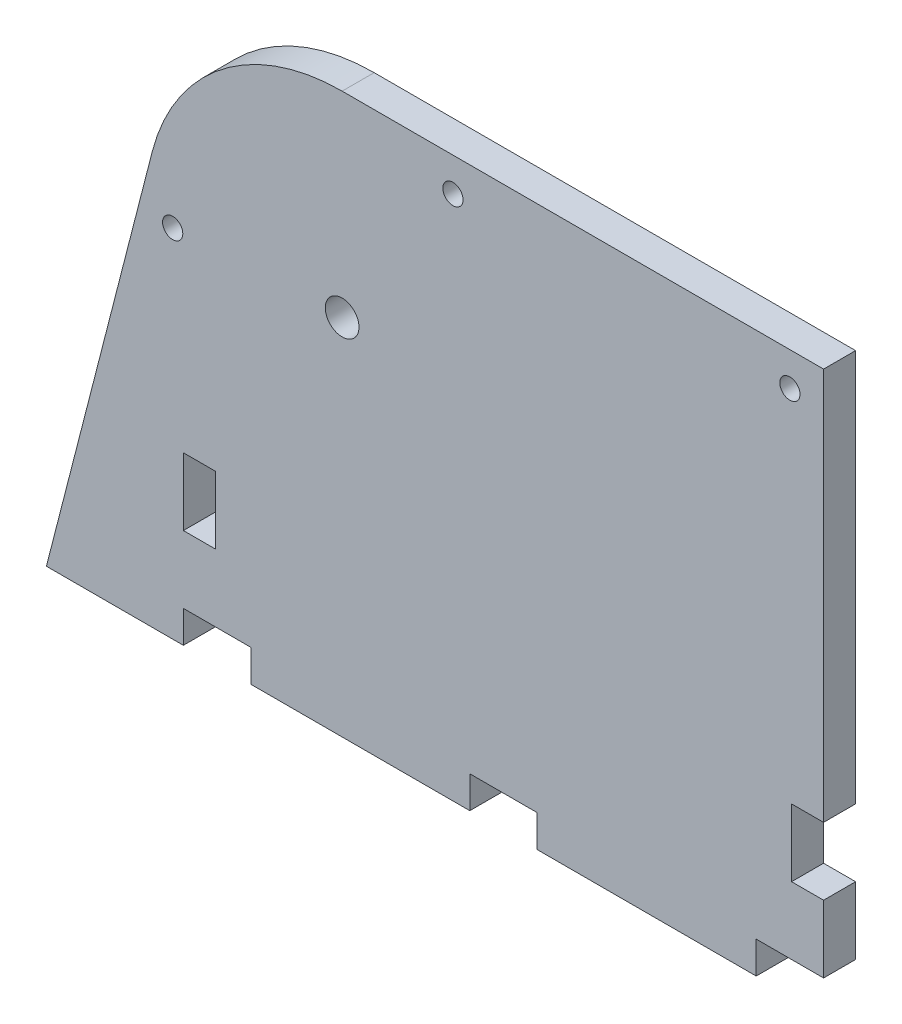
ISO-10303-21;
HEADER;
FILE_DESCRIPTION(('STEP AP214'),'2;1');
FILE_NAME('part.step','',(''),(''),'','','');
FILE_SCHEMA(('AUTOMOTIVE_DESIGN { 1 0 10303 214 1 1 1 1 }'));
ENDSEC;
DATA;
#1=APPLICATION_CONTEXT('core data for automotive mechanical design processes');
#2=APPLICATION_PROTOCOL_DEFINITION('international standard','automotive_design',2000,#1);
#3=PRODUCT_CONTEXT('',#1,'mechanical');
#4=PRODUCT('Part','Part','',(#3));
#5=PRODUCT_RELATED_PRODUCT_CATEGORY('part','',(#4));
#6=PRODUCT_DEFINITION_FORMATION('','',#4);
#7=PRODUCT_DEFINITION_CONTEXT('part definition',#1,'design');
#8=PRODUCT_DEFINITION('design','',#6,#7);
#9=PRODUCT_DEFINITION_SHAPE('','',#8);
#10=(LENGTH_UNIT() NAMED_UNIT(*) SI_UNIT(.MILLI.,.METRE.));
#11=(NAMED_UNIT(*) PLANE_ANGLE_UNIT() SI_UNIT($,.RADIAN.));
#12=(NAMED_UNIT(*) SI_UNIT($,.STERADIAN.) SOLID_ANGLE_UNIT());
#13=UNCERTAINTY_MEASURE_WITH_UNIT(LENGTH_MEASURE(1.E-05),#10,'distance_accuracy_value','');
#14=(GEOMETRIC_REPRESENTATION_CONTEXT(3) GLOBAL_UNCERTAINTY_ASSIGNED_CONTEXT((#13)) GLOBAL_UNIT_ASSIGNED_CONTEXT((#10,
#11,#12)) REPRESENTATION_CONTEXT('',''));
#15=CARTESIAN_POINT('',(0.,0.,0.));
#16=DIRECTION('',(0.,0.,1.));
#17=DIRECTION('',(1.,0.,0.));
#18=AXIS2_PLACEMENT_3D('',#15,#16,#17);
#19=CARTESIAN_POINT('',(105.,0.,4.75));
#20=DIRECTION('',(0.,1.,0.));
#21=DIRECTION('',(-1.,0.,0.));
#22=AXIS2_PLACEMENT_3D('',#19,#20,#21);
#23=PLANE('',#22);
#24=DIRECTION('',(1.,0.,0.));
#25=VECTOR('',#24,1.);
#26=CARTESIAN_POINT('',(105.,0.,0.));
#27=LINE('',#26,#25);
#28=CARTESIAN_POINT('',(20.,0.,0.));
#29=VERTEX_POINT('',#28);
#30=CARTESIAN_POINT('',(52.5,0.,0.));
#31=VERTEX_POINT('',#30);
#32=EDGE_CURVE('E209',#29,#31,#27,.T.);
#33=ORIENTED_EDGE('',*,*,#32,.T.);
#34=DIRECTION('',(0.,0.,1.));
#35=VECTOR('',#34,1.);
#36=CARTESIAN_POINT('',(52.5,0.,0.));
#37=LINE('',#36,#35);
#38=CARTESIAN_POINT('',(52.5,0.,4.75));
#39=VERTEX_POINT('',#38);
#40=EDGE_CURVE('E189',#31,#39,#37,.T.);
#41=ORIENTED_EDGE('',*,*,#40,.T.);
#42=DIRECTION('',(1.,0.,0.));
#43=VECTOR('',#42,1.);
#44=CARTESIAN_POINT('',(105.,0.,4.75));
#45=LINE('',#44,#43);
#46=CARTESIAN_POINT('',(20.,0.,4.75));
#47=VERTEX_POINT('',#46);
#48=EDGE_CURVE('E272',#47,#39,#45,.T.);
#49=ORIENTED_EDGE('',*,*,#48,.F.);
#50=DIRECTION('',(0.,0.,1.));
#51=VECTOR('',#50,1.);
#52=CARTESIAN_POINT('',(20.,0.,0.));
#53=LINE('',#52,#51);
#54=EDGE_CURVE('E216',#29,#47,#53,.T.);
#55=ORIENTED_EDGE('',*,*,#54,.F.);
#56=EDGE_LOOP('',(#33,#41,#49,#55));
#57=FACE_BOUND('',#56,.T.);
#58=ADVANCED_FACE('F33',(#57),#23,.F.);
#59=CARTESIAN_POINT('',(-10.3247928552616,0.,0.));
#60=VERTEX_POINT('',#59);
#61=CARTESIAN_POINT('',(10.,0.,0.));
#62=VERTEX_POINT('',#61);
#63=EDGE_CURVE('E217',#60,#62,#27,.T.);
#64=ORIENTED_EDGE('',*,*,#63,.T.);
#65=DIRECTION('',(0.,0.,1.));
#66=VECTOR('',#65,1.);
#67=CARTESIAN_POINT('',(10.,0.,0.));
#68=LINE('',#67,#66);
#69=CARTESIAN_POINT('',(10.,0.,4.75));
#70=VERTEX_POINT('',#69);
#71=EDGE_CURVE('E268',#62,#70,#68,.T.);
#72=ORIENTED_EDGE('',*,*,#71,.T.);
#73=CARTESIAN_POINT('',(-10.3247928552616,0.,4.75));
#74=VERTEX_POINT('',#73);
#75=EDGE_CURVE('E267',#74,#70,#45,.T.);
#76=ORIENTED_EDGE('',*,*,#75,.F.);
#77=DIRECTION('',(0.,0.,-1.));
#78=VECTOR('',#77,1.);
#79=CARTESIAN_POINT('',(-10.3247928552616,0.,4.75));
#80=LINE('',#79,#78);
#81=EDGE_CURVE('E238',#74,#60,#80,.T.);
#82=ORIENTED_EDGE('',*,*,#81,.T.);
#83=EDGE_LOOP('',(#64,#72,#76,#82));
#84=FACE_BOUND('',#83,.T.);
#85=ADVANCED_FACE('F264',(#84),#23,.F.);
#86=CARTESIAN_POINT('',(105.,83.,4.75));
#87=DIRECTION('',(-1.,0.,0.));
#88=DIRECTION('',(0.,-1.,0.));
#89=AXIS2_PLACEMENT_3D('',#86,#87,#88);
#90=PLANE('',#89);
#91=DIRECTION('',(0.,1.,0.));
#92=VECTOR('',#91,1.);
#93=CARTESIAN_POINT('',(105.,83.,0.));
#94=LINE('',#93,#92);
#95=CARTESIAN_POINT('',(105.,4.75000000000003,0.));
#96=VERTEX_POINT('',#95);
#97=CARTESIAN_POINT('',(105.,14.75,0.));
#98=VERTEX_POINT('',#97);
#99=EDGE_CURVE('E229',#96,#98,#94,.T.);
#100=ORIENTED_EDGE('',*,*,#99,.T.);
#101=DIRECTION('',(0.,0.,1.));
#102=VECTOR('',#101,1.);
#103=CARTESIAN_POINT('',(105.,14.75,0.));
#104=LINE('',#103,#102);
#105=CARTESIAN_POINT('',(105.,14.75,4.75));
#106=VERTEX_POINT('',#105);
#107=EDGE_CURVE('E325',#98,#106,#104,.T.);
#108=ORIENTED_EDGE('',*,*,#107,.T.);
#109=DIRECTION('',(0.,1.,0.));
#110=VECTOR('',#109,1.);
#111=CARTESIAN_POINT('',(105.,83.,4.75));
#112=LINE('',#111,#110);
#113=CARTESIAN_POINT('',(105.,4.75,4.75));
#114=VERTEX_POINT('',#113);
#115=EDGE_CURVE('E274',#114,#106,#112,.T.);
#116=ORIENTED_EDGE('',*,*,#115,.F.);
#117=DIRECTION('',(0.,0.,1.));
#118=VECTOR('',#117,1.);
#119=CARTESIAN_POINT('',(105.,4.75,0.));
#120=LINE('',#119,#118);
#121=EDGE_CURVE('E297',#96,#114,#120,.T.);
#122=ORIENTED_EDGE('',*,*,#121,.F.);
#123=EDGE_LOOP('',(#100,#108,#116,#122));
#124=FACE_BOUND('',#123,.T.);
#125=ADVANCED_FACE('F406',(#124),#90,.F.);
#126=CARTESIAN_POINT('',(33.5613886077065,53.9097221037271,4.75));
#127=DIRECTION('',(0.,0.,-1.));
#128=DIRECTION('',(-1.,0.,0.));
#129=AXIS2_PLACEMENT_3D('',#126,#127,#128);
#130=PLANE('',#129);
#131=CARTESIAN_POINT('',(8.41486022586613,52.8440056136109,4.75));
#132=DIRECTION('',(0.,0.,-1.));
#133=DIRECTION('',(-1.,0.,0.));
#134=AXIS2_PLACEMENT_3D('',#131,#132,#133);
#135=CIRCLE('',#134,1.5);
#136=CARTESIAN_POINT('',(9.91486022586613,52.8440056136109,4.75));
#137=VERTEX_POINT('',#136);
#138=EDGE_CURVE('E472',#137,#137,#135,.F.);
#139=ORIENTED_EDGE('',*,*,#138,.F.);
#140=EDGE_LOOP('',(#139));
#141=FACE_BOUND('',#140,.T.);
#142=CARTESIAN_POINT('',(50.,78.,4.75));
#143=DIRECTION('',(0.,0.,1.));
#144=DIRECTION('',(1.,0.,0.));
#145=AXIS2_PLACEMENT_3D('',#142,#143,#144);
#146=CIRCLE('',#145,1.5);
#147=CARTESIAN_POINT('',(51.5,78.,4.75));
#148=VERTEX_POINT('',#147);
#149=EDGE_CURVE('E475',#148,#148,#146,.T.);
#150=ORIENTED_EDGE('',*,*,#149,.F.);
#151=EDGE_LOOP('',(#150));
#152=FACE_BOUND('',#151,.T.);
#153=CARTESIAN_POINT('',(100.,78.,4.75));
#154=DIRECTION('',(0.,0.,1.));
#155=DIRECTION('',(1.,0.,0.));
#156=AXIS2_PLACEMENT_3D('',#153,#154,#155);
#157=CIRCLE('',#156,1.5);
#158=CARTESIAN_POINT('',(101.5,78.,4.75));
#159=VERTEX_POINT('',#158);
#160=EDGE_CURVE('E468',#159,#159,#157,.T.);
#161=ORIENTED_EDGE('',*,*,#160,.F.);
#162=EDGE_LOOP('',(#161));
#163=FACE_BOUND('',#162,.T.);
#164=DIRECTION('',(1.,0.,0.));
#165=VECTOR('',#164,1.);
#166=CARTESIAN_POINT('',(10.,14.75,4.75));
#167=LINE('',#166,#165);
#168=CARTESIAN_POINT('',(10.,14.75,4.75));
#169=VERTEX_POINT('',#168);
#170=CARTESIAN_POINT('',(14.75,14.75,4.75));
#171=VERTEX_POINT('',#170);
#172=EDGE_CURVE('E346',#169,#171,#167,.T.);
#173=ORIENTED_EDGE('',*,*,#172,.F.);
#174=DIRECTION('',(0.,-1.,0.));
#175=VECTOR('',#174,1.);
#176=CARTESIAN_POINT('',(10.,14.75,4.75));
#177=LINE('',#176,#175);
#178=CARTESIAN_POINT('',(10.,24.75,4.75));
#179=VERTEX_POINT('',#178);
#180=EDGE_CURVE('E49',#179,#169,#177,.T.);
#181=ORIENTED_EDGE('',*,*,#180,.F.);
#182=DIRECTION('',(-1.,0.,0.));
#183=VECTOR('',#182,1.);
#184=CARTESIAN_POINT('',(10.,24.75,4.75));
#185=LINE('',#184,#183);
#186=CARTESIAN_POINT('',(14.75,24.75,4.75));
#187=VERTEX_POINT('',#186);
#188=EDGE_CURVE('E337',#187,#179,#185,.T.);
#189=ORIENTED_EDGE('',*,*,#188,.F.);
#190=DIRECTION('',(0.,1.,0.));
#191=VECTOR('',#190,1.);
#192=CARTESIAN_POINT('',(14.75,14.75,4.75));
#193=LINE('',#192,#191);
#194=EDGE_CURVE('E350',#171,#187,#193,.T.);
#195=ORIENTED_EDGE('',*,*,#194,.F.);
#196=EDGE_LOOP('',(#173,#181,#189,#195));
#197=FACE_BOUND('',#196,.T.);
#198=ORIENTED_EDGE('',*,*,#115,.T.);
#199=DIRECTION('',(1.,0.,0.));
#200=VECTOR('',#199,1.);
#201=CARTESIAN_POINT('',(105.,14.75,4.75));
#202=LINE('',#201,#200);
#203=CARTESIAN_POINT('',(100.25,14.75,4.75));
#204=VERTEX_POINT('',#203);
#205=EDGE_CURVE('E311',#204,#106,#202,.T.);
#206=ORIENTED_EDGE('',*,*,#205,.F.);
#207=DIRECTION('',(0.,-1.,0.));
#208=VECTOR('',#207,1.);
#209=CARTESIAN_POINT('',(100.25,24.75,4.75));
#210=LINE('',#209,#208);
#211=CARTESIAN_POINT('',(100.25,24.75,4.75));
#212=VERTEX_POINT('',#211);
#213=EDGE_CURVE('E320',#212,#204,#210,.T.);
#214=ORIENTED_EDGE('',*,*,#213,.F.);
#215=DIRECTION('',(-1.,0.,0.));
#216=VECTOR('',#215,1.);
#217=CARTESIAN_POINT('',(105.,24.75,4.75));
#218=LINE('',#217,#216);
#219=CARTESIAN_POINT('',(105.,24.75,4.75));
#220=VERTEX_POINT('',#219);
#221=EDGE_CURVE('E317',#220,#212,#218,.T.);
#222=ORIENTED_EDGE('',*,*,#221,.F.);
#223=CARTESIAN_POINT('',(105.,83.,4.75));
#224=VERTEX_POINT('',#223);
#225=EDGE_CURVE('E271',#220,#224,#112,.T.);
#226=ORIENTED_EDGE('',*,*,#225,.T.);
#227=DIRECTION('',(-1.,0.,0.));
#228=VECTOR('',#227,1.);
#229=CARTESIAN_POINT('',(33.5613886077065,83.,4.75));
#230=LINE('',#229,#228);
#231=CARTESIAN_POINT('',(33.5613886077065,83.,4.75));
#232=VERTEX_POINT('',#231);
#233=EDGE_CURVE('E430',#224,#232,#230,.T.);
#234=ORIENTED_EDGE('',*,*,#233,.T.);
#235=CARTESIAN_POINT('',(33.5613886077065,53.9097221037271,4.75));
#236=DIRECTION('',(0.,0.,1.));
#237=DIRECTION('',(-1.,0.,0.));
#238=AXIS2_PLACEMENT_3D('',#235,#236,#237);
#239=CIRCLE('',#238,29.0902778962729);
#240=CARTESIAN_POINT('',(5.38622005558548,61.1487928411874,4.75));
#241=VERTEX_POINT('',#240);
#242=EDGE_CURVE('E251',#232,#241,#239,.T.);
#243=ORIENTED_EDGE('',*,*,#242,.T.);
#244=DIRECTION('',(-0.248848455943689,-0.968542433750035,0.));
#245=VECTOR('',#244,1.);
#246=CARTESIAN_POINT('',(-9.68542433750036,2.48848455943689,4.75));
#247=LINE('',#246,#245);
#248=EDGE_CURVE('E226',#241,#74,#247,.T.);
#249=ORIENTED_EDGE('',*,*,#248,.T.);
#250=ORIENTED_EDGE('',*,*,#75,.T.);
#251=DIRECTION('',(0.,-1.,0.));
#252=VECTOR('',#251,1.);
#253=CARTESIAN_POINT('',(10.,0.,4.75));
#254=LINE('',#253,#252);
#255=CARTESIAN_POINT('',(10.,4.75,4.75));
#256=VERTEX_POINT('',#255);
#257=EDGE_CURVE('E369',#256,#70,#254,.T.);
#258=ORIENTED_EDGE('',*,*,#257,.F.);
#259=DIRECTION('',(-1.,0.,0.));
#260=VECTOR('',#259,1.);
#261=CARTESIAN_POINT('',(10.,4.75,4.75));
#262=LINE('',#261,#260);
#263=CARTESIAN_POINT('',(20.,4.75,4.75));
#264=VERTEX_POINT('',#263);
#265=EDGE_CURVE('E364',#264,#256,#262,.T.);
#266=ORIENTED_EDGE('',*,*,#265,.F.);
#267=DIRECTION('',(0.,1.,0.));
#268=VECTOR('',#267,1.);
#269=CARTESIAN_POINT('',(20.,0.,4.75));
#270=LINE('',#269,#268);
#271=EDGE_CURVE('E371',#47,#264,#270,.T.);
#272=ORIENTED_EDGE('',*,*,#271,.F.);
#273=ORIENTED_EDGE('',*,*,#48,.T.);
#274=DIRECTION('',(0.,-1.,0.));
#275=VECTOR('',#274,1.);
#276=CARTESIAN_POINT('',(52.5,0.,4.75));
#277=LINE('',#276,#275);
#278=CARTESIAN_POINT('',(52.5,4.75,4.75));
#279=VERTEX_POINT('',#278);
#280=EDGE_CURVE('E195',#279,#39,#277,.T.);
#281=ORIENTED_EDGE('',*,*,#280,.F.);
#282=DIRECTION('',(-1.,0.,0.));
#283=VECTOR('',#282,1.);
#284=CARTESIAN_POINT('',(52.5,4.75,4.75));
#285=LINE('',#284,#283);
#286=CARTESIAN_POINT('',(62.5,4.75,4.75));
#287=VERTEX_POINT('',#286);
#288=EDGE_CURVE('E213',#287,#279,#285,.T.);
#289=ORIENTED_EDGE('',*,*,#288,.F.);
#290=DIRECTION('',(0.,1.,0.));
#291=VECTOR('',#290,1.);
#292=CARTESIAN_POINT('',(62.5,0.,4.75));
#293=LINE('',#292,#291);
#294=CARTESIAN_POINT('',(62.5,0.,4.75));
#295=VERTEX_POINT('',#294);
#296=EDGE_CURVE('E288',#295,#287,#293,.T.);
#297=ORIENTED_EDGE('',*,*,#296,.F.);
#298=CARTESIAN_POINT('',(95.,0.,4.75));
#299=VERTEX_POINT('',#298);
#300=EDGE_CURVE('E237',#295,#299,#45,.T.);
#301=ORIENTED_EDGE('',*,*,#300,.T.);
#302=DIRECTION('',(0.,-1.,0.));
#303=VECTOR('',#302,1.);
#304=CARTESIAN_POINT('',(95.,0.,4.75));
#305=LINE('',#304,#303);
#306=CARTESIAN_POINT('',(95.,4.75,4.75));
#307=VERTEX_POINT('',#306);
#308=EDGE_CURVE('E285',#307,#299,#305,.T.);
#309=ORIENTED_EDGE('',*,*,#308,.F.);
#310=DIRECTION('',(-1.,0.,0.));
#311=VECTOR('',#310,1.);
#312=CARTESIAN_POINT('',(95.,4.75,4.75));
#313=LINE('',#312,#311);
#314=EDGE_CURVE('E451',#114,#307,#313,.T.);
#315=ORIENTED_EDGE('',*,*,#314,.F.);
#316=EDGE_LOOP('',(#198,#206,#214,#222,#226,#234,#243,#249,#250,#258,#266,#272,#273,#281,#289,
#297,#301,#309,#315));
#317=FACE_BOUND('',#316,.T.);
#318=CARTESIAN_POINT('',(33.5613886077065,53.9097221037271,4.75));
#319=DIRECTION('',(0.,0.,1.));
#320=DIRECTION('',(1.,0.,0.));
#321=AXIS2_PLACEMENT_3D('',#318,#319,#320);
#322=CIRCLE('',#321,2.5);
#323=CARTESIAN_POINT('',(36.0613886077065,53.9097221037271,4.75));
#324=VERTEX_POINT('',#323);
#325=EDGE_CURVE('E223',#324,#324,#322,.T.);
#326=ORIENTED_EDGE('',*,*,#325,.F.);
#327=EDGE_LOOP('',(#326));
#328=FACE_BOUND('',#327,.T.);
#329=ADVANCED_FACE('F282',(#141,#152,#163,#197,#317,#328),#130,.F.);
#330=CARTESIAN_POINT('',(33.5613886077065,53.9097221037271,0.));
#331=DIRECTION('',(0.,0.,-1.));
#332=DIRECTION('',(-1.,0.,0.));
#333=AXIS2_PLACEMENT_3D('',#330,#331,#332);
#334=PLANE('',#333);
#335=CARTESIAN_POINT('',(8.41486022586613,52.8440056136109,0.));
#336=DIRECTION('',(0.,0.,-1.));
#337=DIRECTION('',(-1.,0.,0.));
#338=AXIS2_PLACEMENT_3D('',#335,#336,#337);
#339=CIRCLE('',#338,1.5);
#340=CARTESIAN_POINT('',(9.91486022586613,52.8440056136109,0.));
#341=VERTEX_POINT('',#340);
#342=EDGE_CURVE('E37',#341,#341,#339,.F.);
#343=ORIENTED_EDGE('',*,*,#342,.T.);
#344=EDGE_LOOP('',(#343));
#345=FACE_BOUND('',#344,.T.);
#346=CARTESIAN_POINT('',(50.,78.,0.));
#347=DIRECTION('',(0.,0.,1.));
#348=DIRECTION('',(1.,0.,0.));
#349=AXIS2_PLACEMENT_3D('',#346,#347,#348);
#350=CIRCLE('',#349,1.5);
#351=CARTESIAN_POINT('',(51.5,78.,0.));
#352=VERTEX_POINT('',#351);
#353=EDGE_CURVE('E347',#352,#352,#350,.T.);
#354=ORIENTED_EDGE('',*,*,#353,.T.);
#355=EDGE_LOOP('',(#354));
#356=FACE_BOUND('',#355,.T.);
#357=CARTESIAN_POINT('',(100.,78.,0.));
#358=DIRECTION('',(0.,0.,1.));
#359=DIRECTION('',(1.,0.,0.));
#360=AXIS2_PLACEMENT_3D('',#357,#358,#359);
#361=CIRCLE('',#360,1.5);
#362=CARTESIAN_POINT('',(101.5,78.,0.));
#363=VERTEX_POINT('',#362);
#364=EDGE_CURVE('E471',#363,#363,#361,.T.);
#365=ORIENTED_EDGE('',*,*,#364,.T.);
#366=EDGE_LOOP('',(#365));
#367=FACE_BOUND('',#366,.T.);
#368=DIRECTION('',(0.,-1.,0.));
#369=VECTOR('',#368,1.);
#370=CARTESIAN_POINT('',(10.,14.75,0.));
#371=LINE('',#370,#369);
#372=CARTESIAN_POINT('',(10.,24.75,0.));
#373=VERTEX_POINT('',#372);
#374=CARTESIAN_POINT('',(10.,14.75,0.));
#375=VERTEX_POINT('',#374);
#376=EDGE_CURVE('E333',#373,#375,#371,.T.);
#377=ORIENTED_EDGE('',*,*,#376,.T.);
#378=DIRECTION('',(1.,0.,0.));
#379=VECTOR('',#378,1.);
#380=CARTESIAN_POINT('',(10.,14.75,0.));
#381=LINE('',#380,#379);
#382=CARTESIAN_POINT('',(14.75,14.75,0.));
#383=VERTEX_POINT('',#382);
#384=EDGE_CURVE('E336',#375,#383,#381,.T.);
#385=ORIENTED_EDGE('',*,*,#384,.T.);
#386=DIRECTION('',(0.,1.,0.));
#387=VECTOR('',#386,1.);
#388=CARTESIAN_POINT('',(14.75,14.75,0.));
#389=LINE('',#388,#387);
#390=CARTESIAN_POINT('',(14.75,24.75,0.));
#391=VERTEX_POINT('',#390);
#392=EDGE_CURVE('E57',#383,#391,#389,.T.);
#393=ORIENTED_EDGE('',*,*,#392,.T.);
#394=DIRECTION('',(-1.,0.,0.));
#395=VECTOR('',#394,1.);
#396=CARTESIAN_POINT('',(10.,24.75,0.));
#397=LINE('',#396,#395);
#398=EDGE_CURVE('E341',#391,#373,#397,.T.);
#399=ORIENTED_EDGE('',*,*,#398,.T.);
#400=EDGE_LOOP('',(#377,#385,#393,#399));
#401=FACE_BOUND('',#400,.T.);
#402=DIRECTION('',(1.,0.,0.));
#403=VECTOR('',#402,1.);
#404=CARTESIAN_POINT('',(105.,14.75,0.));
#405=LINE('',#404,#403);
#406=CARTESIAN_POINT('',(100.25,14.75,0.));
#407=VERTEX_POINT('',#406);
#408=EDGE_CURVE('E314',#407,#98,#405,.T.);
#409=ORIENTED_EDGE('',*,*,#408,.T.);
#410=ORIENTED_EDGE('',*,*,#99,.F.);
#411=DIRECTION('',(-1.,0.,0.));
#412=VECTOR('',#411,1.);
#413=CARTESIAN_POINT('',(95.,4.75,0.));
#414=LINE('',#413,#412);
#415=CARTESIAN_POINT('',(95.,4.75,0.));
#416=VERTEX_POINT('',#415);
#417=EDGE_CURVE('E298',#96,#416,#414,.T.);
#418=ORIENTED_EDGE('',*,*,#417,.T.);
#419=DIRECTION('',(0.,-1.,0.));
#420=VECTOR('',#419,1.);
#421=CARTESIAN_POINT('',(95.,0.,0.));
#422=LINE('',#421,#420);
#423=CARTESIAN_POINT('',(95.,0.,0.));
#424=VERTEX_POINT('',#423);
#425=EDGE_CURVE('E303',#416,#424,#422,.T.);
#426=ORIENTED_EDGE('',*,*,#425,.T.);
#427=CARTESIAN_POINT('',(62.5,0.,0.));
#428=VERTEX_POINT('',#427);
#429=EDGE_CURVE('E218',#428,#424,#27,.T.);
#430=ORIENTED_EDGE('',*,*,#429,.F.);
#431=DIRECTION('',(0.,1.,0.));
#432=VECTOR('',#431,1.);
#433=CARTESIAN_POINT('',(62.5,0.,0.));
#434=LINE('',#433,#432);
#435=CARTESIAN_POINT('',(62.5,4.75,0.));
#436=VERTEX_POINT('',#435);
#437=EDGE_CURVE('E212',#428,#436,#434,.T.);
#438=ORIENTED_EDGE('',*,*,#437,.T.);
#439=DIRECTION('',(-1.,0.,0.));
#440=VECTOR('',#439,1.);
#441=CARTESIAN_POINT('',(52.5,4.75,0.));
#442=LINE('',#441,#440);
#443=CARTESIAN_POINT('',(52.5,4.75,0.));
#444=VERTEX_POINT('',#443);
#445=EDGE_CURVE('E201',#436,#444,#442,.T.);
#446=ORIENTED_EDGE('',*,*,#445,.T.);
#447=DIRECTION('',(0.,-1.,0.));
#448=VECTOR('',#447,1.);
#449=CARTESIAN_POINT('',(52.5,0.,0.));
#450=LINE('',#449,#448);
#451=EDGE_CURVE('E192',#444,#31,#450,.T.);
#452=ORIENTED_EDGE('',*,*,#451,.T.);
#453=ORIENTED_EDGE('',*,*,#32,.F.);
#454=DIRECTION('',(0.,1.,0.));
#455=VECTOR('',#454,1.);
#456=CARTESIAN_POINT('',(20.,0.,0.));
#457=LINE('',#456,#455);
#458=CARTESIAN_POINT('',(20.,4.75,0.));
#459=VERTEX_POINT('',#458);
#460=EDGE_CURVE('E363',#29,#459,#457,.T.);
#461=ORIENTED_EDGE('',*,*,#460,.T.);
#462=DIRECTION('',(-1.,0.,0.));
#463=VECTOR('',#462,1.);
#464=CARTESIAN_POINT('',(10.,4.75,0.));
#465=LINE('',#464,#463);
#466=CARTESIAN_POINT('',(10.,4.75,0.));
#467=VERTEX_POINT('',#466);
#468=EDGE_CURVE('E366',#459,#467,#465,.T.);
#469=ORIENTED_EDGE('',*,*,#468,.T.);
#470=DIRECTION('',(0.,-1.,0.));
#471=VECTOR('',#470,1.);
#472=CARTESIAN_POINT('',(10.,0.,0.));
#473=LINE('',#472,#471);
#474=EDGE_CURVE('E361',#467,#62,#473,.T.);
#475=ORIENTED_EDGE('',*,*,#474,.T.);
#476=ORIENTED_EDGE('',*,*,#63,.F.);
#477=DIRECTION('',(-0.24884845594369,-0.968542433750035,0.));
#478=VECTOR('',#477,1.);
#479=CARTESIAN_POINT('',(-9.68542433750036,2.48848455943689,0.));
#480=LINE('',#479,#478);
#481=CARTESIAN_POINT('',(5.38622005558548,61.1487928411874,0.));
#482=VERTEX_POINT('',#481);
#483=EDGE_CURVE('E235',#482,#60,#480,.T.);
#484=ORIENTED_EDGE('',*,*,#483,.F.);
#485=CARTESIAN_POINT('',(33.5613886077065,53.9097221037271,0.));
#486=DIRECTION('',(0.,0.,1.));
#487=DIRECTION('',(-1.,0.,0.));
#488=AXIS2_PLACEMENT_3D('',#485,#486,#487);
#489=CIRCLE('',#488,29.0902778962729);
#490=CARTESIAN_POINT('',(33.5613886077065,83.,0.));
#491=VERTEX_POINT('',#490);
#492=EDGE_CURVE('E232',#491,#482,#489,.T.);
#493=ORIENTED_EDGE('',*,*,#492,.F.);
#494=DIRECTION('',(-1.,0.,0.));
#495=VECTOR('',#494,1.);
#496=CARTESIAN_POINT('',(33.5613886077065,83.,0.));
#497=LINE('',#496,#495);
#498=CARTESIAN_POINT('',(105.,83.,0.));
#499=VERTEX_POINT('',#498);
#500=EDGE_CURVE('E230',#499,#491,#497,.T.);
#501=ORIENTED_EDGE('',*,*,#500,.F.);
#502=CARTESIAN_POINT('',(105.,24.75,0.));
#503=VERTEX_POINT('',#502);
#504=EDGE_CURVE('E221',#503,#499,#94,.T.);
#505=ORIENTED_EDGE('',*,*,#504,.F.);
#506=DIRECTION('',(-1.,0.,0.));
#507=VECTOR('',#506,1.);
#508=CARTESIAN_POINT('',(105.,24.75,0.));
#509=LINE('',#508,#507);
#510=CARTESIAN_POINT('',(100.25,24.75,0.));
#511=VERTEX_POINT('',#510);
#512=EDGE_CURVE('E307',#503,#511,#509,.T.);
#513=ORIENTED_EDGE('',*,*,#512,.T.);
#514=DIRECTION('',(0.,-1.,0.));
#515=VECTOR('',#514,1.);
#516=CARTESIAN_POINT('',(100.25,24.75,0.));
#517=LINE('',#516,#515);
#518=EDGE_CURVE('E310',#511,#407,#517,.T.);
#519=ORIENTED_EDGE('',*,*,#518,.T.);
#520=EDGE_LOOP('',(#409,#410,#418,#426,#430,#438,#446,#452,#453,#461,#469,#475,#476,#484,#493,
#501,#505,#513,#519));
#521=FACE_BOUND('',#520,.T.);
#522=CARTESIAN_POINT('',(33.5613886077065,53.9097221037271,0.));
#523=DIRECTION('',(0.,0.,1.));
#524=DIRECTION('',(1.,0.,0.));
#525=AXIS2_PLACEMENT_3D('',#522,#523,#524);
#526=CIRCLE('',#525,2.5);
#527=CARTESIAN_POINT('',(36.0613886077065,53.9097221037271,0.));
#528=VERTEX_POINT('',#527);
#529=EDGE_CURVE('E379',#528,#528,#526,.T.);
#530=ORIENTED_EDGE('',*,*,#529,.T.);
#531=EDGE_LOOP('',(#530));
#532=FACE_BOUND('',#531,.T.);
#533=ADVANCED_FACE('F206',(#345,#356,#367,#401,#521,#532),#334,.T.);
#534=ORIENTED_EDGE('',*,*,#429,.T.);
#535=DIRECTION('',(0.,0.,1.));
#536=VECTOR('',#535,1.);
#537=CARTESIAN_POINT('',(95.,0.,0.));
#538=LINE('',#537,#536);
#539=EDGE_CURVE('E293',#424,#299,#538,.T.);
#540=ORIENTED_EDGE('',*,*,#539,.T.);
#541=ORIENTED_EDGE('',*,*,#300,.F.);
#542=DIRECTION('',(0.,0.,1.));
#543=VECTOR('',#542,1.);
#544=CARTESIAN_POINT('',(62.5,0.,0.));
#545=LINE('',#544,#543);
#546=EDGE_CURVE('E200',#428,#295,#545,.T.);
#547=ORIENTED_EDGE('',*,*,#546,.F.);
#548=EDGE_LOOP('',(#534,#540,#541,#547));
#549=FACE_BOUND('',#548,.T.);
#550=ADVANCED_FACE('F35',(#549),#23,.F.);
#551=ORIENTED_EDGE('',*,*,#225,.F.);
#552=DIRECTION('',(0.,0.,1.));
#553=VECTOR('',#552,1.);
#554=CARTESIAN_POINT('',(105.,24.75,0.));
#555=LINE('',#554,#553);
#556=EDGE_CURVE('E316',#503,#220,#555,.T.);
#557=ORIENTED_EDGE('',*,*,#556,.F.);
#558=ORIENTED_EDGE('',*,*,#504,.T.);
#559=DIRECTION('',(0.,0.,-1.));
#560=VECTOR('',#559,1.);
#561=CARTESIAN_POINT('',(105.,83.,4.75));
#562=LINE('',#561,#560);
#563=EDGE_CURVE('E11',#224,#499,#562,.T.);
#564=ORIENTED_EDGE('',*,*,#563,.F.);
#565=EDGE_LOOP('',(#551,#557,#558,#564));
#566=FACE_BOUND('',#565,.T.);
#567=ADVANCED_FACE('F408',(#566),#90,.F.);
#568=CARTESIAN_POINT('',(33.5613886077065,83.,4.75));
#569=DIRECTION('',(0.,-1.,0.));
#570=DIRECTION('',(0.,0.,-1.));
#571=AXIS2_PLACEMENT_3D('',#568,#569,#570);
#572=PLANE('',#571);
#573=ORIENTED_EDGE('',*,*,#500,.T.);
#574=DIRECTION('',(0.,0.,-1.));
#575=VECTOR('',#574,1.);
#576=CARTESIAN_POINT('',(33.5613886077065,83.,4.75));
#577=LINE('',#576,#575);
#578=EDGE_CURVE('E42',#232,#491,#577,.T.);
#579=ORIENTED_EDGE('',*,*,#578,.F.);
#580=ORIENTED_EDGE('',*,*,#233,.F.);
#581=ORIENTED_EDGE('',*,*,#563,.T.);
#582=EDGE_LOOP('',(#573,#579,#580,#581));
#583=FACE_BOUND('',#582,.T.);
#584=ADVANCED_FACE('F413',(#583),#572,.F.);
#585=CARTESIAN_POINT('',(33.5613886077065,53.9097221037271,4.75));
#586=DIRECTION('',(0.,0.,-1.));
#587=DIRECTION('',(-1.,0.,0.));
#588=AXIS2_PLACEMENT_3D('',#585,#586,#587);
#589=CYLINDRICAL_SURFACE('',#588,29.0902778962729);
#590=ORIENTED_EDGE('',*,*,#492,.T.);
#591=DIRECTION('',(0.,0.,-1.));
#592=VECTOR('',#591,1.);
#593=CARTESIAN_POINT('',(5.38622005558548,61.1487928411874,4.75));
#594=LINE('',#593,#592);
#595=EDGE_CURVE('E241',#241,#482,#594,.T.);
#596=ORIENTED_EDGE('',*,*,#595,.F.);
#597=ORIENTED_EDGE('',*,*,#242,.F.);
#598=ORIENTED_EDGE('',*,*,#578,.T.);
#599=EDGE_LOOP('',(#590,#596,#597,#598));
#600=FACE_BOUND('',#599,.T.);
#601=ADVANCED_FACE('F249',(#600),#589,.T.);
#602=CARTESIAN_POINT('',(-9.68542433750036,2.48848455943689,4.75));
#603=DIRECTION('',(0.968542433750035,-0.24884845594369,0.));
#604=DIRECTION('',(0.24884845594369,0.968542433750035,0.));
#605=AXIS2_PLACEMENT_3D('',#602,#603,#604);
#606=PLANE('',#605);
#607=ORIENTED_EDGE('',*,*,#483,.T.);
#608=ORIENTED_EDGE('',*,*,#81,.F.);
#609=ORIENTED_EDGE('',*,*,#248,.F.);
#610=ORIENTED_EDGE('',*,*,#595,.T.);
#611=EDGE_LOOP('',(#607,#608,#609,#610));
#612=FACE_BOUND('',#611,.T.);
#613=ADVANCED_FACE('F260',(#612),#606,.F.);
#614=CARTESIAN_POINT('',(33.5613886077065,53.9097221037271,4.75));
#615=DIRECTION('',(0.,0.,-1.));
#616=DIRECTION('',(-1.,0.,0.));
#617=AXIS2_PLACEMENT_3D('',#614,#615,#616);
#618=CYLINDRICAL_SURFACE('',#617,2.5);
#619=ORIENTED_EDGE('',*,*,#325,.T.);
#620=EDGE_LOOP('',(#619));
#621=FACE_BOUND('',#620,.T.);
#622=ORIENTED_EDGE('',*,*,#529,.F.);
#623=EDGE_LOOP('',(#622));
#624=FACE_BOUND('',#623,.T.);
#625=ADVANCED_FACE('F388',(#621,#624),#618,.F.);
#626=CARTESIAN_POINT('',(95.,0.,0.));
#627=DIRECTION('',(-1.,0.,0.));
#628=DIRECTION('',(0.,0.,1.));
#629=AXIS2_PLACEMENT_3D('',#626,#627,#628);
#630=PLANE('',#629);
#631=ORIENTED_EDGE('',*,*,#308,.T.);
#632=ORIENTED_EDGE('',*,*,#539,.F.);
#633=ORIENTED_EDGE('',*,*,#425,.F.);
#634=DIRECTION('',(0.,0.,1.));
#635=VECTOR('',#634,1.);
#636=CARTESIAN_POINT('',(95.,4.75,0.));
#637=LINE('',#636,#635);
#638=EDGE_CURVE('E300',#416,#307,#637,.T.);
#639=ORIENTED_EDGE('',*,*,#638,.T.);
#640=EDGE_LOOP('',(#631,#632,#633,#639));
#641=FACE_BOUND('',#640,.T.);
#642=ADVANCED_FACE('F390',(#641),#630,.F.);
#643=CARTESIAN_POINT('',(95.,4.75,0.));
#644=DIRECTION('',(0.,1.,0.));
#645=DIRECTION('',(0.,0.,1.));
#646=AXIS2_PLACEMENT_3D('',#643,#644,#645);
#647=PLANE('',#646);
#648=ORIENTED_EDGE('',*,*,#314,.T.);
#649=ORIENTED_EDGE('',*,*,#638,.F.);
#650=ORIENTED_EDGE('',*,*,#417,.F.);
#651=ORIENTED_EDGE('',*,*,#121,.T.);
#652=EDGE_LOOP('',(#648,#649,#650,#651));
#653=FACE_BOUND('',#652,.T.);
#654=ADVANCED_FACE('F397',(#653),#647,.F.);
#655=CARTESIAN_POINT('',(105.,14.75,0.));
#656=DIRECTION('',(0.,-1.,0.));
#657=DIRECTION('',(0.,0.,-1.));
#658=AXIS2_PLACEMENT_3D('',#655,#656,#657);
#659=PLANE('',#658);
#660=ORIENTED_EDGE('',*,*,#205,.T.);
#661=ORIENTED_EDGE('',*,*,#107,.F.);
#662=ORIENTED_EDGE('',*,*,#408,.F.);
#663=DIRECTION('',(0.,0.,1.));
#664=VECTOR('',#663,1.);
#665=CARTESIAN_POINT('',(100.25,14.75,0.));
#666=LINE('',#665,#664);
#667=EDGE_CURVE('E328',#407,#204,#666,.T.);
#668=ORIENTED_EDGE('',*,*,#667,.T.);
#669=EDGE_LOOP('',(#660,#661,#662,#668));
#670=FACE_BOUND('',#669,.T.);
#671=ADVANCED_FACE('F443',(#670),#659,.F.);
#672=CARTESIAN_POINT('',(100.25,24.75,0.));
#673=DIRECTION('',(-1.,0.,0.));
#674=DIRECTION('',(0.,0.,1.));
#675=AXIS2_PLACEMENT_3D('',#672,#673,#674);
#676=PLANE('',#675);
#677=ORIENTED_EDGE('',*,*,#213,.T.);
#678=ORIENTED_EDGE('',*,*,#667,.F.);
#679=ORIENTED_EDGE('',*,*,#518,.F.);
#680=DIRECTION('',(0.,0.,1.));
#681=VECTOR('',#680,1.);
#682=CARTESIAN_POINT('',(100.25,24.75,0.));
#683=LINE('',#682,#681);
#684=EDGE_CURVE('E330',#511,#212,#683,.T.);
#685=ORIENTED_EDGE('',*,*,#684,.T.);
#686=EDGE_LOOP('',(#677,#678,#679,#685));
#687=FACE_BOUND('',#686,.T.);
#688=ADVANCED_FACE('F439',(#687),#676,.F.);
#689=CARTESIAN_POINT('',(105.,24.75,0.));
#690=DIRECTION('',(0.,1.,0.));
#691=DIRECTION('',(0.,0.,1.));
#692=AXIS2_PLACEMENT_3D('',#689,#690,#691);
#693=PLANE('',#692);
#694=ORIENTED_EDGE('',*,*,#221,.T.);
#695=ORIENTED_EDGE('',*,*,#684,.F.);
#696=ORIENTED_EDGE('',*,*,#512,.F.);
#697=ORIENTED_EDGE('',*,*,#556,.T.);
#698=EDGE_LOOP('',(#694,#695,#696,#697));
#699=FACE_BOUND('',#698,.T.);
#700=ADVANCED_FACE('F435',(#699),#693,.F.);
#701=CARTESIAN_POINT('',(10.,0.,0.));
#702=DIRECTION('',(-1.,0.,0.));
#703=DIRECTION('',(0.,0.,1.));
#704=AXIS2_PLACEMENT_3D('',#701,#702,#703);
#705=PLANE('',#704);
#706=ORIENTED_EDGE('',*,*,#257,.T.);
#707=ORIENTED_EDGE('',*,*,#71,.F.);
#708=ORIENTED_EDGE('',*,*,#474,.F.);
#709=DIRECTION('',(0.,0.,1.));
#710=VECTOR('',#709,1.);
#711=CARTESIAN_POINT('',(10.,4.75,0.));
#712=LINE('',#711,#710);
#713=EDGE_CURVE('E377',#467,#256,#712,.T.);
#714=ORIENTED_EDGE('',*,*,#713,.T.);
#715=EDGE_LOOP('',(#706,#707,#708,#714));
#716=FACE_BOUND('',#715,.T.);
#717=ADVANCED_FACE('F518',(#716),#705,.F.);
#718=CARTESIAN_POINT('',(10.,4.75,0.));
#719=DIRECTION('',(0.,1.,0.));
#720=DIRECTION('',(-1.,0.,0.));
#721=AXIS2_PLACEMENT_3D('',#718,#719,#720);
#722=PLANE('',#721);
#723=ORIENTED_EDGE('',*,*,#265,.T.);
#724=ORIENTED_EDGE('',*,*,#713,.F.);
#725=ORIENTED_EDGE('',*,*,#468,.F.);
#726=DIRECTION('',(0.,0.,1.));
#727=VECTOR('',#726,1.);
#728=CARTESIAN_POINT('',(20.,4.75,0.));
#729=LINE('',#728,#727);
#730=EDGE_CURVE('E380',#459,#264,#729,.T.);
#731=ORIENTED_EDGE('',*,*,#730,.T.);
#732=EDGE_LOOP('',(#723,#724,#725,#731));
#733=FACE_BOUND('',#732,.T.);
#734=ADVANCED_FACE('F531',(#733),#722,.F.);
#735=CARTESIAN_POINT('',(20.,0.,0.));
#736=DIRECTION('',(1.,0.,0.));
#737=DIRECTION('',(0.,1.,0.));
#738=AXIS2_PLACEMENT_3D('',#735,#736,#737);
#739=PLANE('',#738);
#740=ORIENTED_EDGE('',*,*,#271,.T.);
#741=ORIENTED_EDGE('',*,*,#730,.F.);
#742=ORIENTED_EDGE('',*,*,#460,.F.);
#743=ORIENTED_EDGE('',*,*,#54,.T.);
#744=EDGE_LOOP('',(#740,#741,#742,#743));
#745=FACE_BOUND('',#744,.T.);
#746=ADVANCED_FACE('F509',(#745),#739,.F.);
#747=CARTESIAN_POINT('',(52.5,0.,0.));
#748=DIRECTION('',(-1.,0.,0.));
#749=DIRECTION('',(0.,0.,1.));
#750=AXIS2_PLACEMENT_3D('',#747,#748,#749);
#751=PLANE('',#750);
#752=ORIENTED_EDGE('',*,*,#280,.T.);
#753=ORIENTED_EDGE('',*,*,#40,.F.);
#754=ORIENTED_EDGE('',*,*,#451,.F.);
#755=DIRECTION('',(0.,0.,1.));
#756=VECTOR('',#755,1.);
#757=CARTESIAN_POINT('',(52.5,4.75,0.));
#758=LINE('',#757,#756);
#759=EDGE_CURVE('E372',#444,#279,#758,.T.);
#760=ORIENTED_EDGE('',*,*,#759,.T.);
#761=EDGE_LOOP('',(#752,#753,#754,#760));
#762=FACE_BOUND('',#761,.T.);
#763=ADVANCED_FACE('F191',(#762),#751,.F.);
#764=CARTESIAN_POINT('',(52.5,4.75,0.));
#765=DIRECTION('',(0.,1.,0.));
#766=DIRECTION('',(-1.,0.,0.));
#767=AXIS2_PLACEMENT_3D('',#764,#765,#766);
#768=PLANE('',#767);
#769=ORIENTED_EDGE('',*,*,#288,.T.);
#770=ORIENTED_EDGE('',*,*,#759,.F.);
#771=ORIENTED_EDGE('',*,*,#445,.F.);
#772=DIRECTION('',(0.,0.,1.));
#773=VECTOR('',#772,1.);
#774=CARTESIAN_POINT('',(62.5,4.75,0.));
#775=LINE('',#774,#773);
#776=EDGE_CURVE('E463',#436,#287,#775,.T.);
#777=ORIENTED_EDGE('',*,*,#776,.T.);
#778=EDGE_LOOP('',(#769,#770,#771,#777));
#779=FACE_BOUND('',#778,.T.);
#780=ADVANCED_FACE('F500',(#779),#768,.F.);
#781=CARTESIAN_POINT('',(62.5,0.,0.));
#782=DIRECTION('',(1.,0.,0.));
#783=DIRECTION('',(0.,0.,-1.));
#784=AXIS2_PLACEMENT_3D('',#781,#782,#783);
#785=PLANE('',#784);
#786=ORIENTED_EDGE('',*,*,#296,.T.);
#787=ORIENTED_EDGE('',*,*,#776,.F.);
#788=ORIENTED_EDGE('',*,*,#437,.F.);
#789=ORIENTED_EDGE('',*,*,#546,.T.);
#790=EDGE_LOOP('',(#786,#787,#788,#789));
#791=FACE_BOUND('',#790,.T.);
#792=ADVANCED_FACE('F466',(#791),#785,.F.);
#793=CARTESIAN_POINT('',(10.,14.75,0.));
#794=DIRECTION('',(-1.,0.,0.));
#795=DIRECTION('',(0.,0.,1.));
#796=AXIS2_PLACEMENT_3D('',#793,#794,#795);
#797=PLANE('',#796);
#798=ORIENTED_EDGE('',*,*,#180,.T.);
#799=DIRECTION('',(0.,0.,1.));
#800=VECTOR('',#799,1.);
#801=CARTESIAN_POINT('',(10.,14.75,0.));
#802=LINE('',#801,#800);
#803=EDGE_CURVE('E344',#375,#169,#802,.T.);
#804=ORIENTED_EDGE('',*,*,#803,.F.);
#805=ORIENTED_EDGE('',*,*,#376,.F.);
#806=DIRECTION('',(0.,0.,1.));
#807=VECTOR('',#806,1.);
#808=CARTESIAN_POINT('',(10.,24.75,0.));
#809=LINE('',#808,#807);
#810=EDGE_CURVE('E321',#373,#179,#809,.T.);
#811=ORIENTED_EDGE('',*,*,#810,.T.);
#812=EDGE_LOOP('',(#798,#804,#805,#811));
#813=FACE_BOUND('',#812,.T.);
#814=ADVANCED_FACE('F506',(#813),#797,.F.);
#815=CARTESIAN_POINT('',(10.,24.75,0.));
#816=DIRECTION('',(0.,1.,0.));
#817=DIRECTION('',(0.,0.,1.));
#818=AXIS2_PLACEMENT_3D('',#815,#816,#817);
#819=PLANE('',#818);
#820=ORIENTED_EDGE('',*,*,#188,.T.);
#821=ORIENTED_EDGE('',*,*,#810,.F.);
#822=ORIENTED_EDGE('',*,*,#398,.F.);
#823=DIRECTION('',(0.,0.,1.));
#824=VECTOR('',#823,1.);
#825=CARTESIAN_POINT('',(14.75,24.75,0.));
#826=LINE('',#825,#824);
#827=EDGE_CURVE('E356',#391,#187,#826,.T.);
#828=ORIENTED_EDGE('',*,*,#827,.T.);
#829=EDGE_LOOP('',(#820,#821,#822,#828));
#830=FACE_BOUND('',#829,.T.);
#831=ADVANCED_FACE('F519',(#830),#819,.F.);
#832=CARTESIAN_POINT('',(14.75,14.75,0.));
#833=DIRECTION('',(1.,0.,0.));
#834=DIRECTION('',(0.,0.,-1.));
#835=AXIS2_PLACEMENT_3D('',#832,#833,#834);
#836=PLANE('',#835);
#837=ORIENTED_EDGE('',*,*,#194,.T.);
#838=ORIENTED_EDGE('',*,*,#827,.F.);
#839=ORIENTED_EDGE('',*,*,#392,.F.);
#840=DIRECTION('',(0.,0.,1.));
#841=VECTOR('',#840,1.);
#842=CARTESIAN_POINT('',(14.75,14.75,0.));
#843=LINE('',#842,#841);
#844=EDGE_CURVE('E358',#383,#171,#843,.T.);
#845=ORIENTED_EDGE('',*,*,#844,.T.);
#846=EDGE_LOOP('',(#837,#838,#839,#845));
#847=FACE_BOUND('',#846,.T.);
#848=ADVANCED_FACE('F522',(#847),#836,.F.);
#849=CARTESIAN_POINT('',(10.,14.75,0.));
#850=DIRECTION('',(0.,-1.,0.));
#851=DIRECTION('',(0.,0.,-1.));
#852=AXIS2_PLACEMENT_3D('',#849,#850,#851);
#853=PLANE('',#852);
#854=ORIENTED_EDGE('',*,*,#172,.T.);
#855=ORIENTED_EDGE('',*,*,#844,.F.);
#856=ORIENTED_EDGE('',*,*,#384,.F.);
#857=ORIENTED_EDGE('',*,*,#803,.T.);
#858=EDGE_LOOP('',(#854,#855,#856,#857));
#859=FACE_BOUND('',#858,.T.);
#860=ADVANCED_FACE('F498',(#859),#853,.F.);
#861=CARTESIAN_POINT('',(100.,78.,0.));
#862=DIRECTION('',(0.,0.,1.));
#863=DIRECTION('',(1.,0.,0.));
#864=AXIS2_PLACEMENT_3D('',#861,#862,#863);
#865=CYLINDRICAL_SURFACE('',#864,1.5);
#866=ORIENTED_EDGE('',*,*,#364,.F.);
#867=EDGE_LOOP('',(#866));
#868=FACE_BOUND('',#867,.T.);
#869=ORIENTED_EDGE('',*,*,#160,.T.);
#870=EDGE_LOOP('',(#869));
#871=FACE_BOUND('',#870,.T.);
#872=ADVANCED_FACE('F492',(#868,#871),#865,.F.);
#873=CARTESIAN_POINT('',(50.,78.,0.));
#874=DIRECTION('',(0.,0.,1.));
#875=DIRECTION('',(1.,0.,0.));
#876=AXIS2_PLACEMENT_3D('',#873,#874,#875);
#877=CYLINDRICAL_SURFACE('',#876,1.5);
#878=ORIENTED_EDGE('',*,*,#353,.F.);
#879=EDGE_LOOP('',(#878));
#880=FACE_BOUND('',#879,.T.);
#881=ORIENTED_EDGE('',*,*,#149,.T.);
#882=EDGE_LOOP('',(#881));
#883=FACE_BOUND('',#882,.T.);
#884=ADVANCED_FACE('F487',(#880,#883),#877,.F.);
#885=CARTESIAN_POINT('',(8.41486022586613,52.8440056136109,12.75));
#886=DIRECTION('',(0.,0.,-1.));
#887=DIRECTION('',(1.,0.,0.));
#888=AXIS2_PLACEMENT_3D('',#885,#886,#887);
#889=CYLINDRICAL_SURFACE('',#888,1.5);
#890=CARTESIAN_POINT('',(9.91486022586613,52.8440056136109,0.));
#891=CARTESIAN_POINT('',(9.91486022586613,52.8440056136109,0.0494791666666682));
#892=CARTESIAN_POINT('',(9.91486022586613,52.8440056136109,0.0989583333333346));
#893=CARTESIAN_POINT('',(9.91486022586613,52.8440056136109,0.197916666666668));
#894=CARTESIAN_POINT('',(9.91486022586613,52.8440056136109,0.247395833333335));
#895=CARTESIAN_POINT('',(9.91486022586613,52.8440056136109,0.346354166666668));
#896=CARTESIAN_POINT('',(9.91486022586613,52.8440056136109,0.395833333333335));
#897=CARTESIAN_POINT('',(9.91486022586613,52.8440056136109,0.494791666666668));
#898=CARTESIAN_POINT('',(9.91486022586613,52.8440056136109,0.544270833333335));
#899=CARTESIAN_POINT('',(9.91486022586613,52.8440056136109,0.643229166666669));
#900=CARTESIAN_POINT('',(9.91486022586613,52.8440056136109,0.692708333333335));
#901=CARTESIAN_POINT('',(9.91486022586613,52.8440056136109,0.791666666666669));
#902=CARTESIAN_POINT('',(9.91486022586613,52.8440056136109,0.841145833333336));
#903=CARTESIAN_POINT('',(9.91486022586613,52.8440056136109,0.940104166666669));
#904=CARTESIAN_POINT('',(9.91486022586613,52.8440056136109,0.989583333333335));
#905=CARTESIAN_POINT('',(9.91486022586613,52.8440056136109,1.08854166666667));
#906=CARTESIAN_POINT('',(9.91486022586613,52.8440056136109,1.13802083333334));
#907=CARTESIAN_POINT('',(9.91486022586613,52.8440056136109,1.23697916666667));
#908=CARTESIAN_POINT('',(9.91486022586613,52.8440056136109,1.28645833333334));
#909=CARTESIAN_POINT('',(9.91486022586613,52.8440056136109,1.38541666666667));
#910=CARTESIAN_POINT('',(9.91486022586613,52.8440056136109,1.43489583333333));
#911=CARTESIAN_POINT('',(9.91486022586613,52.8440056136109,1.53385416666667));
#912=CARTESIAN_POINT('',(9.91486022586613,52.8440056136109,1.58333333333334));
#913=CARTESIAN_POINT('',(9.91486022586613,52.8440056136109,1.68229166666667));
#914=CARTESIAN_POINT('',(9.91486022586613,52.8440056136109,1.73177083333334));
#915=CARTESIAN_POINT('',(9.91486022586613,52.8440056136109,1.83072916666667));
#916=CARTESIAN_POINT('',(9.91486022586613,52.8440056136109,1.88020833333334));
#917=CARTESIAN_POINT('',(9.91486022586613,52.8440056136109,1.97916666666667));
#918=CARTESIAN_POINT('',(9.91486022586613,52.8440056136109,2.02864583333334));
#919=CARTESIAN_POINT('',(9.91486022586613,52.8440056136109,2.12760416666667));
#920=CARTESIAN_POINT('',(9.91486022586613,52.8440056136109,2.17708333333334));
#921=CARTESIAN_POINT('',(9.91486022586613,52.8440056136109,2.27604166666667));
#922=CARTESIAN_POINT('',(9.91486022586613,52.8440056136109,2.32552083333334));
#923=CARTESIAN_POINT('',(9.91486022586613,52.8440056136109,2.42447916666667));
#924=CARTESIAN_POINT('',(9.91486022586613,52.8440056136109,2.47395833333333));
#925=CARTESIAN_POINT('',(9.91486022586613,52.8440056136109,2.57291666666667));
#926=CARTESIAN_POINT('',(9.91486022586613,52.8440056136109,2.62239583333334));
#927=CARTESIAN_POINT('',(9.91486022586613,52.8440056136109,2.72135416666667));
#928=CARTESIAN_POINT('',(9.91486022586613,52.8440056136109,2.77083333333334));
#929=CARTESIAN_POINT('',(9.91486022586613,52.8440056136109,2.86979166666667));
#930=CARTESIAN_POINT('',(9.91486022586613,52.8440056136109,2.91927083333334));
#931=CARTESIAN_POINT('',(9.91486022586613,52.8440056136109,3.01822916666667));
#932=CARTESIAN_POINT('',(9.91486022586613,52.8440056136109,3.06770833333334));
#933=CARTESIAN_POINT('',(9.91486022586613,52.8440056136109,3.16666666666667));
#934=CARTESIAN_POINT('',(9.91486022586613,52.8440056136109,3.21614583333334));
#935=CARTESIAN_POINT('',(9.91486022586613,52.8440056136109,3.31510416666667));
#936=CARTESIAN_POINT('',(9.91486022586613,52.8440056136109,3.36458333333334));
#937=CARTESIAN_POINT('',(9.91486022586613,52.8440056136109,3.46354166666667));
#938=CARTESIAN_POINT('',(9.91486022586613,52.8440056136109,3.51302083333333));
#939=CARTESIAN_POINT('',(9.91486022586613,52.8440056136109,3.61197916666667));
#940=CARTESIAN_POINT('',(9.91486022586613,52.8440056136109,3.66145833333334));
#941=CARTESIAN_POINT('',(9.91486022586613,52.8440056136109,3.76041666666667));
#942=CARTESIAN_POINT('',(9.91486022586613,52.8440056136109,3.80989583333334));
#943=CARTESIAN_POINT('',(9.91486022586613,52.8440056136109,3.90885416666667));
#944=CARTESIAN_POINT('',(9.91486022586613,52.8440056136109,3.95833333333334));
#945=CARTESIAN_POINT('',(9.91486022586613,52.8440056136109,4.05729166666667));
#946=CARTESIAN_POINT('',(9.91486022586613,52.8440056136109,4.10677083333334));
#947=CARTESIAN_POINT('',(9.91486022586613,52.8440056136109,4.20572916666667));
#948=CARTESIAN_POINT('',(9.91486022586613,52.8440056136109,4.25520833333334));
#949=CARTESIAN_POINT('',(9.91486022586613,52.8440056136109,4.35416666666667));
#950=CARTESIAN_POINT('',(9.91486022586613,52.8440056136109,4.40364583333334));
#951=CARTESIAN_POINT('',(9.91486022586613,52.8440056136109,4.50260416666667));
#952=CARTESIAN_POINT('',(9.91486022586613,52.8440056136109,4.55208333333333));
#953=CARTESIAN_POINT('',(9.91486022586613,52.8440056136109,4.65104166666667));
#954=CARTESIAN_POINT('',(9.91486022586613,52.8440056136109,4.70052083333333));
#955=CARTESIAN_POINT('',(9.91486022586613,52.8440056136109,4.75));
#956=B_SPLINE_CURVE_WITH_KNOTS('',3,(#890,#891,#892,#893,#894,#895,#896,#897,#898,#899,#900,
#901,#902,#903,#904,#905,#906,#907,#908,#909,#910,#911,#912,#913,#914,#915,#916,#917,#918,#919,
#920,#921,#922,#923,#924,#925,#926,#927,#928,#929,#930,#931,#932,#933,#934,#935,#936,#937,#938,
#939,#940,#941,#942,#943,#944,#945,#946,#947,#948,#949,#950,#951,#952,#953,#954,#955),
.UNSPECIFIED.,.F.,.F.,(4,2,2,2,2,2,2,2,2,2,2,2,2,2,2,2,2,2,2,2,2,2,2,2,2,2,2,2,2,2,2,2,4),(0.,
0.148437499999999,0.296875,0.4453125,0.593750000000001,0.7421875,0.890625000000001,1.0390625,
1.1875,1.3359375,1.484375,1.6328125,1.78125,1.9296875,2.078125,2.2265625,2.375,2.5234375,
2.671875,2.8203125,2.96875,3.1171875,3.265625,3.4140625,3.5625,3.7109375,3.859375,4.0078125,
4.15625,4.3046875,4.453125,4.6015625,4.75),.UNSPECIFIED.);
#957=EDGE_CURVE('BSEAM485',#341,#137,#956,.T.);
#958=ORIENTED_EDGE('',*,*,#342,.F.);
#959=ORIENTED_EDGE('',*,*,#138,.T.);
#960=ORIENTED_EDGE('',*,*,#957,.T.);
#961=ORIENTED_EDGE('',*,*,#957,.F.);
#962=EDGE_LOOP('',(#958,#960,#959,#961));
#963=FACE_BOUND('',#962,.T.);
#964=ADVANCED_FACE('F485',(#963),#889,.F.);
#965=CLOSED_SHELL('',(#58,#85,#125,#329,#533,#550,#567,#584,#601,#613,#625,#642,#654,#671,#688,
#700,#717,#734,#746,#763,#780,#792,#814,#831,#848,#860,#872,#884,#964));
#966=MANIFOLD_SOLID_BREP('B2',#965);
#967=ADVANCED_BREP_SHAPE_REPRESENTATION('',(#18,#966),#14);
#968=SHAPE_DEFINITION_REPRESENTATION(#9,#967);
ENDSEC;
END-ISO-10303-21;
